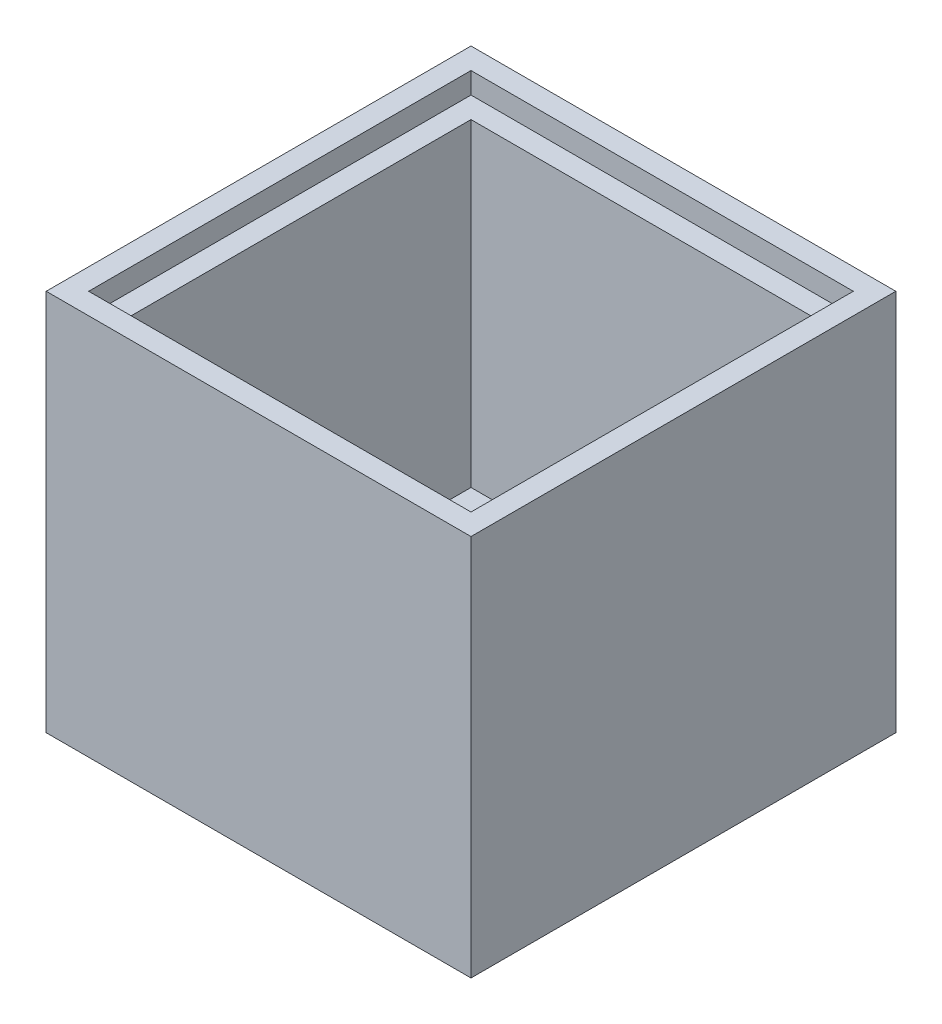
ISO-10303-21;
HEADER;
FILE_DESCRIPTION(('STEP AP214'),'2;1');
FILE_NAME('part.step','',(''),(''),'','','');
FILE_SCHEMA(('AUTOMOTIVE_DESIGN { 1 0 10303 214 1 1 1 1 }'));
ENDSEC;
DATA;
#1=APPLICATION_CONTEXT('core data for automotive mechanical design processes');
#2=APPLICATION_PROTOCOL_DEFINITION('international standard','automotive_design',2000,#1);
#3=PRODUCT_CONTEXT('',#1,'mechanical');
#4=PRODUCT('Part','Part','',(#3));
#5=PRODUCT_RELATED_PRODUCT_CATEGORY('part','',(#4));
#6=PRODUCT_DEFINITION_FORMATION('','',#4);
#7=PRODUCT_DEFINITION_CONTEXT('part definition',#1,'design');
#8=PRODUCT_DEFINITION('design','',#6,#7);
#9=PRODUCT_DEFINITION_SHAPE('','',#8);
#10=(LENGTH_UNIT() NAMED_UNIT(*) SI_UNIT(.MILLI.,.METRE.));
#11=(NAMED_UNIT(*) PLANE_ANGLE_UNIT() SI_UNIT($,.RADIAN.));
#12=(NAMED_UNIT(*) SI_UNIT($,.STERADIAN.) SOLID_ANGLE_UNIT());
#13=UNCERTAINTY_MEASURE_WITH_UNIT(LENGTH_MEASURE(1.E-05),#10,'distance_accuracy_value','');
#14=(GEOMETRIC_REPRESENTATION_CONTEXT(3) GLOBAL_UNCERTAINTY_ASSIGNED_CONTEXT((#13)) GLOBAL_UNIT_ASSIGNED_CONTEXT((#10,
#11,#12)) REPRESENTATION_CONTEXT('',''));
#15=CARTESIAN_POINT('',(0.,0.,0.));
#16=DIRECTION('',(0.,0.,1.));
#17=DIRECTION('',(1.,0.,0.));
#18=AXIS2_PLACEMENT_3D('',#15,#16,#17);
#19=CARTESIAN_POINT('',(-24.9999999999999,45.,25.));
#20=DIRECTION('',(1.,0.,0.));
#21=DIRECTION('',(0.,0.,-1.));
#22=AXIS2_PLACEMENT_3D('',#19,#20,#21);
#23=PLANE('',#22);
#24=DIRECTION('',(0.,0.,1.));
#25=VECTOR('',#24,1.);
#26=CARTESIAN_POINT('',(-24.9999999999999,0.,25.));
#27=LINE('',#26,#25);
#28=CARTESIAN_POINT('',(-24.9999999999999,0.,-25.));
#29=VERTEX_POINT('',#28);
#30=CARTESIAN_POINT('',(-24.9999999999999,0.,25.));
#31=VERTEX_POINT('',#30);
#32=EDGE_CURVE('E206',#29,#31,#27,.T.);
#33=ORIENTED_EDGE('',*,*,#32,.T.);
#34=DIRECTION('',(0.,-1.,0.));
#35=VECTOR('',#34,1.);
#36=CARTESIAN_POINT('',(-24.9999999999999,45.,25.));
#37=LINE('',#36,#35);
#38=CARTESIAN_POINT('',(-24.9999999999999,45.,25.));
#39=VERTEX_POINT('',#38);
#40=EDGE_CURVE('E47',#39,#31,#37,.T.);
#41=ORIENTED_EDGE('',*,*,#40,.F.);
#42=DIRECTION('',(0.,0.,1.));
#43=VECTOR('',#42,1.);
#44=CARTESIAN_POINT('',(-24.9999999999999,45.,25.));
#45=LINE('',#44,#43);
#46=CARTESIAN_POINT('',(-24.9999999999999,45.,-25.));
#47=VERTEX_POINT('',#46);
#48=EDGE_CURVE('E218',#47,#39,#45,.T.);
#49=ORIENTED_EDGE('',*,*,#48,.F.);
#50=DIRECTION('',(0.,-1.,0.));
#51=VECTOR('',#50,1.);
#52=CARTESIAN_POINT('',(-24.9999999999999,45.,-25.));
#53=LINE('',#52,#51);
#54=EDGE_CURVE('E232',#47,#29,#53,.T.);
#55=ORIENTED_EDGE('',*,*,#54,.T.);
#56=EDGE_LOOP('',(#33,#41,#49,#55));
#57=FACE_BOUND('',#56,.T.);
#58=ADVANCED_FACE('F39',(#57),#23,.F.);
#59=CARTESIAN_POINT('',(25.0000000000001,45.,25.));
#60=DIRECTION('',(0.,0.,-1.));
#61=DIRECTION('',(-1.,0.,0.));
#62=AXIS2_PLACEMENT_3D('',#59,#60,#61);
#63=PLANE('',#62);
#64=DIRECTION('',(1.,0.,0.));
#65=VECTOR('',#64,1.);
#66=CARTESIAN_POINT('',(25.0000000000001,0.,25.));
#67=LINE('',#66,#65);
#68=CARTESIAN_POINT('',(25.0000000000001,0.,25.));
#69=VERTEX_POINT('',#68);
#70=EDGE_CURVE('E236',#31,#69,#67,.T.);
#71=ORIENTED_EDGE('',*,*,#70,.T.);
#72=DIRECTION('',(0.,-1.,0.));
#73=VECTOR('',#72,1.);
#74=CARTESIAN_POINT('',(25.0000000000001,45.,25.));
#75=LINE('',#74,#73);
#76=CARTESIAN_POINT('',(25.0000000000001,45.,25.));
#77=VERTEX_POINT('',#76);
#78=EDGE_CURVE('E251',#77,#69,#75,.T.);
#79=ORIENTED_EDGE('',*,*,#78,.F.);
#80=DIRECTION('',(1.,0.,0.));
#81=VECTOR('',#80,1.);
#82=CARTESIAN_POINT('',(25.0000000000001,45.,25.));
#83=LINE('',#82,#81);
#84=EDGE_CURVE('E222',#39,#77,#83,.T.);
#85=ORIENTED_EDGE('',*,*,#84,.F.);
#86=ORIENTED_EDGE('',*,*,#40,.T.);
#87=EDGE_LOOP('',(#71,#79,#85,#86));
#88=FACE_BOUND('',#87,.T.);
#89=ADVANCED_FACE('F258',(#88),#63,.F.);
#90=CARTESIAN_POINT('',(25.0000000000001,45.,25.));
#91=DIRECTION('',(-1.,0.,0.));
#92=DIRECTION('',(0.,0.,1.));
#93=AXIS2_PLACEMENT_3D('',#90,#91,#92);
#94=PLANE('',#93);
#95=DIRECTION('',(0.,0.,-1.));
#96=VECTOR('',#95,1.);
#97=CARTESIAN_POINT('',(25.0000000000001,0.,25.));
#98=LINE('',#97,#96);
#99=CARTESIAN_POINT('',(25.0000000000001,0.,-25.));
#100=VERTEX_POINT('',#99);
#101=EDGE_CURVE('E239',#69,#100,#98,.T.);
#102=ORIENTED_EDGE('',*,*,#101,.T.);
#103=DIRECTION('',(0.,-1.,0.));
#104=VECTOR('',#103,1.);
#105=CARTESIAN_POINT('',(25.0000000000001,45.,-25.));
#106=LINE('',#105,#104);
#107=CARTESIAN_POINT('',(25.0000000000001,45.,-25.));
#108=VERTEX_POINT('',#107);
#109=EDGE_CURVE('E247',#108,#100,#106,.T.);
#110=ORIENTED_EDGE('',*,*,#109,.F.);
#111=DIRECTION('',(0.,0.,-1.));
#112=VECTOR('',#111,1.);
#113=CARTESIAN_POINT('',(25.0000000000001,45.,25.));
#114=LINE('',#113,#112);
#115=EDGE_CURVE('E226',#77,#108,#114,.T.);
#116=ORIENTED_EDGE('',*,*,#115,.F.);
#117=ORIENTED_EDGE('',*,*,#78,.T.);
#118=EDGE_LOOP('',(#102,#110,#116,#117));
#119=FACE_BOUND('',#118,.T.);
#120=ADVANCED_FACE('F270',(#119),#94,.F.);
#121=CARTESIAN_POINT('',(25.0000000000001,45.,-25.));
#122=DIRECTION('',(0.,0.,1.));
#123=DIRECTION('',(1.,0.,0.));
#124=AXIS2_PLACEMENT_3D('',#121,#122,#123);
#125=PLANE('',#124);
#126=DIRECTION('',(-1.,0.,0.));
#127=VECTOR('',#126,1.);
#128=CARTESIAN_POINT('',(25.0000000000001,0.,-25.));
#129=LINE('',#128,#127);
#130=EDGE_CURVE('E223',#100,#29,#129,.T.);
#131=ORIENTED_EDGE('',*,*,#130,.T.);
#132=ORIENTED_EDGE('',*,*,#54,.F.);
#133=DIRECTION('',(-1.,0.,0.));
#134=VECTOR('',#133,1.);
#135=CARTESIAN_POINT('',(25.0000000000001,45.,-25.));
#136=LINE('',#135,#134);
#137=EDGE_CURVE('E229',#108,#47,#136,.T.);
#138=ORIENTED_EDGE('',*,*,#137,.F.);
#139=ORIENTED_EDGE('',*,*,#109,.T.);
#140=EDGE_LOOP('',(#131,#132,#138,#139));
#141=FACE_BOUND('',#140,.T.);
#142=ADVANCED_FACE('F274',(#141),#125,.F.);
#143=CARTESIAN_POINT('',(0.,45.,0.));
#144=DIRECTION('',(0.,1.,0.));
#145=DIRECTION('',(0.,0.,1.));
#146=AXIS2_PLACEMENT_3D('',#143,#144,#145);
#147=PLANE('',#146);
#148=DIRECTION('',(0.,0.,1.));
#149=VECTOR('',#148,1.);
#150=CARTESIAN_POINT('',(-22.5,45.,22.5));
#151=LINE('',#150,#149);
#152=CARTESIAN_POINT('',(-22.5,45.,-22.5));
#153=VERTEX_POINT('',#152);
#154=CARTESIAN_POINT('',(-22.5,45.,22.5));
#155=VERTEX_POINT('',#154);
#156=EDGE_CURVE('E54',#153,#155,#151,.T.);
#157=ORIENTED_EDGE('',*,*,#156,.F.);
#158=DIRECTION('',(-1.,0.,0.));
#159=VECTOR('',#158,1.);
#160=CARTESIAN_POINT('',(22.5,45.,-22.5));
#161=LINE('',#160,#159);
#162=CARTESIAN_POINT('',(22.5,45.,-22.5));
#163=VERTEX_POINT('',#162);
#164=EDGE_CURVE('E150',#163,#153,#161,.T.);
#165=ORIENTED_EDGE('',*,*,#164,.F.);
#166=DIRECTION('',(0.,0.,-1.));
#167=VECTOR('',#166,1.);
#168=CARTESIAN_POINT('',(22.5,45.,22.5));
#169=LINE('',#168,#167);
#170=CARTESIAN_POINT('',(22.5,45.,22.5));
#171=VERTEX_POINT('',#170);
#172=EDGE_CURVE('E154',#171,#163,#169,.T.);
#173=ORIENTED_EDGE('',*,*,#172,.F.);
#174=DIRECTION('',(1.,0.,0.));
#175=VECTOR('',#174,1.);
#176=CARTESIAN_POINT('',(22.5,45.,22.5));
#177=LINE('',#176,#175);
#178=EDGE_CURVE('E163',#155,#171,#177,.T.);
#179=ORIENTED_EDGE('',*,*,#178,.F.);
#180=EDGE_LOOP('',(#157,#165,#173,#179));
#181=FACE_BOUND('',#180,.T.);
#182=ORIENTED_EDGE('',*,*,#48,.T.);
#183=ORIENTED_EDGE('',*,*,#84,.T.);
#184=ORIENTED_EDGE('',*,*,#115,.T.);
#185=ORIENTED_EDGE('',*,*,#137,.T.);
#186=EDGE_LOOP('',(#182,#183,#184,#185));
#187=FACE_BOUND('',#186,.T.);
#188=ADVANCED_FACE('F276',(#181,#187),#147,.T.);
#189=CARTESIAN_POINT('',(0.,0.,0.));
#190=DIRECTION('',(0.,1.,0.));
#191=DIRECTION('',(0.,0.,1.));
#192=AXIS2_PLACEMENT_3D('',#189,#190,#191);
#193=PLANE('',#192);
#194=ORIENTED_EDGE('',*,*,#32,.F.);
#195=ORIENTED_EDGE('',*,*,#130,.F.);
#196=ORIENTED_EDGE('',*,*,#101,.F.);
#197=ORIENTED_EDGE('',*,*,#70,.F.);
#198=EDGE_LOOP('',(#194,#195,#196,#197));
#199=FACE_BOUND('',#198,.T.);
#200=ADVANCED_FACE('F266',(#199),#193,.F.);
#201=CARTESIAN_POINT('',(0.,42.5,0.));
#202=DIRECTION('',(0.,1.,0.));
#203=DIRECTION('',(0.,0.,1.));
#204=AXIS2_PLACEMENT_3D('',#201,#202,#203);
#205=PLANE('',#204);
#206=DIRECTION('',(0.,0.,1.));
#207=VECTOR('',#206,1.);
#208=CARTESIAN_POINT('',(-22.5,42.5,22.5));
#209=LINE('',#208,#207);
#210=CARTESIAN_POINT('',(-22.5,42.5,-22.5));
#211=VERTEX_POINT('',#210);
#212=CARTESIAN_POINT('',(-22.5,42.5,22.5));
#213=VERTEX_POINT('',#212);
#214=EDGE_CURVE('E129',#211,#213,#209,.T.);
#215=ORIENTED_EDGE('',*,*,#214,.T.);
#216=DIRECTION('',(1.,0.,0.));
#217=VECTOR('',#216,1.);
#218=CARTESIAN_POINT('',(22.5,42.5,22.5));
#219=LINE('',#218,#217);
#220=CARTESIAN_POINT('',(22.5,42.5,22.5));
#221=VERTEX_POINT('',#220);
#222=EDGE_CURVE('E139',#213,#221,#219,.T.);
#223=ORIENTED_EDGE('',*,*,#222,.T.);
#224=DIRECTION('',(0.,0.,-1.));
#225=VECTOR('',#224,1.);
#226=CARTESIAN_POINT('',(22.5,42.5,22.5));
#227=LINE('',#226,#225);
#228=CARTESIAN_POINT('',(22.5,42.5,-22.5));
#229=VERTEX_POINT('',#228);
#230=EDGE_CURVE('E145',#221,#229,#227,.T.);
#231=ORIENTED_EDGE('',*,*,#230,.T.);
#232=DIRECTION('',(-1.,0.,0.));
#233=VECTOR('',#232,1.);
#234=CARTESIAN_POINT('',(22.5,42.5,-22.5));
#235=LINE('',#234,#233);
#236=EDGE_CURVE('E136',#229,#211,#235,.T.);
#237=ORIENTED_EDGE('',*,*,#236,.T.);
#238=EDGE_LOOP('',(#215,#223,#231,#237));
#239=FACE_BOUND('',#238,.T.);
#240=DIRECTION('',(0.,0.,-1.));
#241=VECTOR('',#240,1.);
#242=CARTESIAN_POINT('',(-20.,42.5,20.));
#243=LINE('',#242,#241);
#244=CARTESIAN_POINT('',(-20.,42.5,20.));
#245=VERTEX_POINT('',#244);
#246=CARTESIAN_POINT('',(-20.,42.5,-20.));
#247=VERTEX_POINT('',#246);
#248=EDGE_CURVE('E182',#245,#247,#243,.T.);
#249=ORIENTED_EDGE('',*,*,#248,.T.);
#250=DIRECTION('',(1.,0.,0.));
#251=VECTOR('',#250,1.);
#252=CARTESIAN_POINT('',(20.,42.5,-20.));
#253=LINE('',#252,#251);
#254=CARTESIAN_POINT('',(20.,42.5,-20.));
#255=VERTEX_POINT('',#254);
#256=EDGE_CURVE('E179',#247,#255,#253,.T.);
#257=ORIENTED_EDGE('',*,*,#256,.T.);
#258=DIRECTION('',(0.,0.,1.));
#259=VECTOR('',#258,1.);
#260=CARTESIAN_POINT('',(20.,42.5,20.));
#261=LINE('',#260,#259);
#262=CARTESIAN_POINT('',(20.,42.5,20.));
#263=VERTEX_POINT('',#262);
#264=EDGE_CURVE('E61',#255,#263,#261,.T.);
#265=ORIENTED_EDGE('',*,*,#264,.T.);
#266=DIRECTION('',(-1.,0.,0.));
#267=VECTOR('',#266,1.);
#268=CARTESIAN_POINT('',(20.,42.5,20.));
#269=LINE('',#268,#267);
#270=EDGE_CURVE('E11',#263,#245,#269,.T.);
#271=ORIENTED_EDGE('',*,*,#270,.T.);
#272=EDGE_LOOP('',(#249,#257,#265,#271));
#273=FACE_BOUND('',#272,.T.);
#274=ADVANCED_FACE('F147',(#239,#273),#205,.T.);
#275=CARTESIAN_POINT('',(-22.5,42.5,22.5));
#276=DIRECTION('',(-1.,0.,0.));
#277=DIRECTION('',(0.,0.,1.));
#278=AXIS2_PLACEMENT_3D('',#275,#276,#277);
#279=PLANE('',#278);
#280=ORIENTED_EDGE('',*,*,#156,.T.);
#281=DIRECTION('',(0.,1.,0.));
#282=VECTOR('',#281,1.);
#283=CARTESIAN_POINT('',(-22.5,42.5,22.5));
#284=LINE('',#283,#282);
#285=EDGE_CURVE('E125',#213,#155,#284,.T.);
#286=ORIENTED_EDGE('',*,*,#285,.F.);
#287=ORIENTED_EDGE('',*,*,#214,.F.);
#288=DIRECTION('',(0.,1.,0.));
#289=VECTOR('',#288,1.);
#290=CARTESIAN_POINT('',(-22.5,42.5,-22.5));
#291=LINE('',#290,#289);
#292=EDGE_CURVE('E169',#211,#153,#291,.T.);
#293=ORIENTED_EDGE('',*,*,#292,.T.);
#294=EDGE_LOOP('',(#280,#286,#287,#293));
#295=FACE_BOUND('',#294,.T.);
#296=ADVANCED_FACE('F127',(#295),#279,.F.);
#297=CARTESIAN_POINT('',(22.5,42.5,-22.5));
#298=DIRECTION('',(0.,0.,-1.));
#299=DIRECTION('',(-1.,0.,0.));
#300=AXIS2_PLACEMENT_3D('',#297,#298,#299);
#301=PLANE('',#300);
#302=ORIENTED_EDGE('',*,*,#164,.T.);
#303=ORIENTED_EDGE('',*,*,#292,.F.);
#304=ORIENTED_EDGE('',*,*,#236,.F.);
#305=DIRECTION('',(0.,1.,0.));
#306=VECTOR('',#305,1.);
#307=CARTESIAN_POINT('',(22.5,42.5,-22.5));
#308=LINE('',#307,#306);
#309=EDGE_CURVE('E172',#229,#163,#308,.T.);
#310=ORIENTED_EDGE('',*,*,#309,.T.);
#311=EDGE_LOOP('',(#302,#303,#304,#310));
#312=FACE_BOUND('',#311,.T.);
#313=ADVANCED_FACE('F343',(#312),#301,.F.);
#314=CARTESIAN_POINT('',(22.5,42.5,22.5));
#315=DIRECTION('',(1.,0.,0.));
#316=DIRECTION('',(0.,0.,-1.));
#317=AXIS2_PLACEMENT_3D('',#314,#315,#316);
#318=PLANE('',#317);
#319=ORIENTED_EDGE('',*,*,#172,.T.);
#320=ORIENTED_EDGE('',*,*,#309,.F.);
#321=ORIENTED_EDGE('',*,*,#230,.F.);
#322=DIRECTION('',(0.,1.,0.));
#323=VECTOR('',#322,1.);
#324=CARTESIAN_POINT('',(22.5,42.5,22.5));
#325=LINE('',#324,#323);
#326=EDGE_CURVE('E135',#221,#171,#325,.T.);
#327=ORIENTED_EDGE('',*,*,#326,.T.);
#328=EDGE_LOOP('',(#319,#320,#321,#327));
#329=FACE_BOUND('',#328,.T.);
#330=ADVANCED_FACE('F352',(#329),#318,.F.);
#331=CARTESIAN_POINT('',(22.5,42.5,22.5));
#332=DIRECTION('',(0.,0.,1.));
#333=DIRECTION('',(1.,0.,0.));
#334=AXIS2_PLACEMENT_3D('',#331,#332,#333);
#335=PLANE('',#334);
#336=ORIENTED_EDGE('',*,*,#178,.T.);
#337=ORIENTED_EDGE('',*,*,#326,.F.);
#338=ORIENTED_EDGE('',*,*,#222,.F.);
#339=ORIENTED_EDGE('',*,*,#285,.T.);
#340=EDGE_LOOP('',(#336,#337,#338,#339));
#341=FACE_BOUND('',#340,.T.);
#342=ADVANCED_FACE('F140',(#341),#335,.F.);
#343=CARTESIAN_POINT('',(0.,5.,0.));
#344=DIRECTION('',(0.,1.,0.));
#345=DIRECTION('',(0.,0.,1.));
#346=AXIS2_PLACEMENT_3D('',#343,#344,#345);
#347=PLANE('',#346);
#348=DIRECTION('',(0.,0.,1.));
#349=VECTOR('',#348,1.);
#350=CARTESIAN_POINT('',(-20.,5.,20.));
#351=LINE('',#350,#349);
#352=CARTESIAN_POINT('',(-20.,5.,-20.));
#353=VERTEX_POINT('',#352);
#354=CARTESIAN_POINT('',(-20.,5.,20.));
#355=VERTEX_POINT('',#354);
#356=EDGE_CURVE('E185',#353,#355,#351,.T.);
#357=ORIENTED_EDGE('',*,*,#356,.T.);
#358=DIRECTION('',(1.,0.,0.));
#359=VECTOR('',#358,1.);
#360=CARTESIAN_POINT('',(20.,5.,20.));
#361=LINE('',#360,#359);
#362=CARTESIAN_POINT('',(20.,5.,20.));
#363=VERTEX_POINT('',#362);
#364=EDGE_CURVE('E189',#355,#363,#361,.T.);
#365=ORIENTED_EDGE('',*,*,#364,.T.);
#366=DIRECTION('',(0.,0.,-1.));
#367=VECTOR('',#366,1.);
#368=CARTESIAN_POINT('',(20.,5.,20.));
#369=LINE('',#368,#367);
#370=CARTESIAN_POINT('',(20.,5.,-20.));
#371=VERTEX_POINT('',#370);
#372=EDGE_CURVE('E193',#363,#371,#369,.T.);
#373=ORIENTED_EDGE('',*,*,#372,.T.);
#374=DIRECTION('',(-1.,0.,0.));
#375=VECTOR('',#374,1.);
#376=CARTESIAN_POINT('',(20.,5.,-20.));
#377=LINE('',#376,#375);
#378=EDGE_CURVE('E197',#371,#353,#377,.T.);
#379=ORIENTED_EDGE('',*,*,#378,.T.);
#380=EDGE_LOOP('',(#357,#365,#373,#379));
#381=FACE_BOUND('',#380,.T.);
#382=ADVANCED_FACE('F315',(#381),#347,.T.);
#383=CARTESIAN_POINT('',(20.,5.,20.));
#384=DIRECTION('',(0.,0.,1.));
#385=DIRECTION('',(1.,0.,0.));
#386=AXIS2_PLACEMENT_3D('',#383,#384,#385);
#387=PLANE('',#386);
#388=ORIENTED_EDGE('',*,*,#270,.F.);
#389=DIRECTION('',(0.,1.,0.));
#390=VECTOR('',#389,1.);
#391=CARTESIAN_POINT('',(20.,5.,20.));
#392=LINE('',#391,#390);
#393=EDGE_CURVE('E211',#363,#263,#392,.T.);
#394=ORIENTED_EDGE('',*,*,#393,.F.);
#395=ORIENTED_EDGE('',*,*,#364,.F.);
#396=DIRECTION('',(0.,1.,0.));
#397=VECTOR('',#396,1.);
#398=CARTESIAN_POINT('',(-20.,5.,20.));
#399=LINE('',#398,#397);
#400=EDGE_CURVE('E201',#355,#245,#399,.T.);
#401=ORIENTED_EDGE('',*,*,#400,.T.);
#402=EDGE_LOOP('',(#388,#394,#395,#401));
#403=FACE_BOUND('',#402,.T.);
#404=ADVANCED_FACE('F318',(#403),#387,.F.);
#405=CARTESIAN_POINT('',(20.,5.,20.));
#406=DIRECTION('',(1.,0.,0.));
#407=DIRECTION('',(0.,0.,-1.));
#408=AXIS2_PLACEMENT_3D('',#405,#406,#407);
#409=PLANE('',#408);
#410=ORIENTED_EDGE('',*,*,#264,.F.);
#411=DIRECTION('',(0.,1.,0.));
#412=VECTOR('',#411,1.);
#413=CARTESIAN_POINT('',(20.,5.,-20.));
#414=LINE('',#413,#412);
#415=EDGE_CURVE('E207',#371,#255,#414,.T.);
#416=ORIENTED_EDGE('',*,*,#415,.F.);
#417=ORIENTED_EDGE('',*,*,#372,.F.);
#418=ORIENTED_EDGE('',*,*,#393,.T.);
#419=EDGE_LOOP('',(#410,#416,#417,#418));
#420=FACE_BOUND('',#419,.T.);
#421=ADVANCED_FACE('F376',(#420),#409,.F.);
#422=CARTESIAN_POINT('',(20.,5.,-20.));
#423=DIRECTION('',(0.,0.,-1.));
#424=DIRECTION('',(-1.,0.,0.));
#425=AXIS2_PLACEMENT_3D('',#422,#423,#424);
#426=PLANE('',#425);
#427=ORIENTED_EDGE('',*,*,#256,.F.);
#428=DIRECTION('',(0.,1.,0.));
#429=VECTOR('',#428,1.);
#430=CARTESIAN_POINT('',(-20.,5.,-20.));
#431=LINE('',#430,#429);
#432=EDGE_CURVE('E202',#353,#247,#431,.T.);
#433=ORIENTED_EDGE('',*,*,#432,.F.);
#434=ORIENTED_EDGE('',*,*,#378,.F.);
#435=ORIENTED_EDGE('',*,*,#415,.T.);
#436=EDGE_LOOP('',(#427,#433,#434,#435));
#437=FACE_BOUND('',#436,.T.);
#438=ADVANCED_FACE('F386',(#437),#426,.F.);
#439=CARTESIAN_POINT('',(-20.,5.,20.));
#440=DIRECTION('',(-1.,0.,0.));
#441=DIRECTION('',(0.,0.,1.));
#442=AXIS2_PLACEMENT_3D('',#439,#440,#441);
#443=PLANE('',#442);
#444=ORIENTED_EDGE('',*,*,#248,.F.);
#445=ORIENTED_EDGE('',*,*,#400,.F.);
#446=ORIENTED_EDGE('',*,*,#356,.F.);
#447=ORIENTED_EDGE('',*,*,#432,.T.);
#448=EDGE_LOOP('',(#444,#445,#446,#447));
#449=FACE_BOUND('',#448,.T.);
#450=ADVANCED_FACE('F396',(#449),#443,.F.);
#451=CLOSED_SHELL('',(#58,#89,#120,#142,#188,#200,#274,#296,#313,#330,#342,#382,#404,#421,#438,#450));
#452=MANIFOLD_SOLID_BREP('B2',#451);
#453=ADVANCED_BREP_SHAPE_REPRESENTATION('',(#18,#452),#14);
#454=SHAPE_DEFINITION_REPRESENTATION(#9,#453);
ENDSEC;
END-ISO-10303-21;
